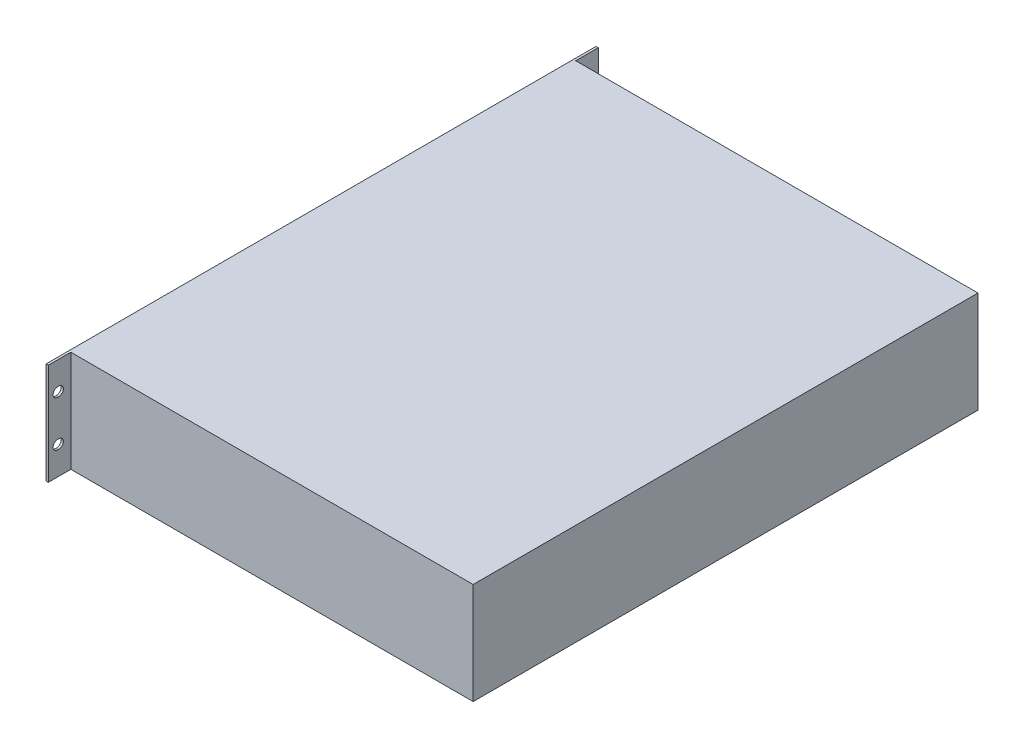
ISO-10303-21;
HEADER;
FILE_DESCRIPTION(('STEP AP214'),'2;1');
FILE_NAME('part.step','',(''),(''),'','','');
FILE_SCHEMA(('AUTOMOTIVE_DESIGN { 1 0 10303 214 1 1 1 1 }'));
ENDSEC;
DATA;
#1=APPLICATION_CONTEXT('core data for automotive mechanical design processes');
#2=APPLICATION_PROTOCOL_DEFINITION('international standard','automotive_design',2000,#1);
#3=PRODUCT_CONTEXT('',#1,'mechanical');
#4=PRODUCT('Part','Part','',(#3));
#5=PRODUCT_RELATED_PRODUCT_CATEGORY('part','',(#4));
#6=PRODUCT_DEFINITION_FORMATION('','',#4);
#7=PRODUCT_DEFINITION_CONTEXT('part definition',#1,'design');
#8=PRODUCT_DEFINITION('design','',#6,#7);
#9=PRODUCT_DEFINITION_SHAPE('','',#8);
#10=(LENGTH_UNIT() NAMED_UNIT(*) SI_UNIT(.MILLI.,.METRE.));
#11=(NAMED_UNIT(*) PLANE_ANGLE_UNIT() SI_UNIT($,.RADIAN.));
#12=(NAMED_UNIT(*) SI_UNIT($,.STERADIAN.) SOLID_ANGLE_UNIT());
#13=UNCERTAINTY_MEASURE_WITH_UNIT(LENGTH_MEASURE(1.E-05),#10,'distance_accuracy_value','');
#14=(GEOMETRIC_REPRESENTATION_CONTEXT(3) GLOBAL_UNCERTAINTY_ASSIGNED_CONTEXT((#13)) GLOBAL_UNIT_ASSIGNED_CONTEXT((#10,
#11,#12)) REPRESENTATION_CONTEXT('',''));
#15=CARTESIAN_POINT('',(0.,0.,0.));
#16=DIRECTION('',(0.,0.,1.));
#17=DIRECTION('',(1.,0.,0.));
#18=AXIS2_PLACEMENT_3D('',#15,#16,#17);
#19=CARTESIAN_POINT('',(177.5,89.,-221.5));
#20=DIRECTION('',(-1.,0.,0.));
#21=DIRECTION('',(0.,0.,1.));
#22=AXIS2_PLACEMENT_3D('',#19,#20,#21);
#23=PLANE('',#22);
#24=DIRECTION('',(0.,0.,-1.));
#25=VECTOR('',#24,1.);
#26=CARTESIAN_POINT('',(177.5,0.,-221.5));
#27=LINE('',#26,#25);
#28=CARTESIAN_POINT('',(177.5,0.,221.5));
#29=VERTEX_POINT('',#28);
#30=CARTESIAN_POINT('',(177.5,0.,-221.5));
#31=VERTEX_POINT('',#30);
#32=EDGE_CURVE('E482',#29,#31,#27,.T.);
#33=ORIENTED_EDGE('',*,*,#32,.T.);
#34=DIRECTION('',(0.,-1.,0.));
#35=VECTOR('',#34,1.);
#36=CARTESIAN_POINT('',(177.5,89.,-221.5));
#37=LINE('',#36,#35);
#38=CARTESIAN_POINT('',(177.5,89.,-221.5));
#39=VERTEX_POINT('',#38);
#40=EDGE_CURVE('E11',#39,#31,#37,.T.);
#41=ORIENTED_EDGE('',*,*,#40,.F.);
#42=DIRECTION('',(0.,0.,-1.));
#43=VECTOR('',#42,1.);
#44=CARTESIAN_POINT('',(177.5,89.,-221.5));
#45=LINE('',#44,#43);
#46=CARTESIAN_POINT('',(177.5,89.,221.5));
#47=VERTEX_POINT('',#46);
#48=EDGE_CURVE('E483',#47,#39,#45,.T.);
#49=ORIENTED_EDGE('',*,*,#48,.F.);
#50=DIRECTION('',(0.,-1.,0.));
#51=VECTOR('',#50,1.);
#52=CARTESIAN_POINT('',(177.5,89.,221.5));
#53=LINE('',#52,#51);
#54=EDGE_CURVE('E48',#47,#29,#53,.T.);
#55=ORIENTED_EDGE('',*,*,#54,.T.);
#56=EDGE_LOOP('',(#33,#41,#49,#55));
#57=FACE_BOUND('',#56,.T.);
#58=ADVANCED_FACE('F40',(#57),#23,.F.);
#59=CARTESIAN_POINT('',(-177.5,89.,-221.5));
#60=DIRECTION('',(0.,0.,1.));
#61=DIRECTION('',(1.,0.,0.));
#62=AXIS2_PLACEMENT_3D('',#59,#60,#61);
#63=PLANE('',#62);
#64=DIRECTION('',(-1.,0.,0.));
#65=VECTOR('',#64,1.);
#66=CARTESIAN_POINT('',(-177.5,0.,-221.5));
#67=LINE('',#66,#65);
#68=CARTESIAN_POINT('',(-175.5,0.,-221.5));
#69=VERTEX_POINT('',#68);
#70=EDGE_CURVE('E500',#31,#69,#67,.T.);
#71=ORIENTED_EDGE('',*,*,#70,.T.);
#72=DIRECTION('',(0.,1.,0.));
#73=VECTOR('',#72,1.);
#74=CARTESIAN_POINT('',(-175.5,89.,-221.5));
#75=LINE('',#74,#73);
#76=CARTESIAN_POINT('',(-175.5,89.,-221.5));
#77=VERTEX_POINT('',#76);
#78=EDGE_CURVE('E478',#69,#77,#75,.T.);
#79=ORIENTED_EDGE('',*,*,#78,.T.);
#80=DIRECTION('',(-1.,0.,0.));
#81=VECTOR('',#80,1.);
#82=CARTESIAN_POINT('',(-177.5,89.,-221.5));
#83=LINE('',#82,#81);
#84=EDGE_CURVE('E487',#39,#77,#83,.T.);
#85=ORIENTED_EDGE('',*,*,#84,.F.);
#86=ORIENTED_EDGE('',*,*,#40,.T.);
#87=EDGE_LOOP('',(#71,#79,#85,#86));
#88=FACE_BOUND('',#87,.T.);
#89=ADVANCED_FACE('F519',(#88),#63,.F.);
#90=CARTESIAN_POINT('',(-177.5,89.,-221.5));
#91=DIRECTION('',(1.,0.,0.));
#92=DIRECTION('',(0.,0.,-1.));
#93=AXIS2_PLACEMENT_3D('',#90,#91,#92);
#94=PLANE('',#93);
#95=DIRECTION('',(0.,0.,1.));
#96=VECTOR('',#95,1.);
#97=CARTESIAN_POINT('',(-177.5,0.,-221.5));
#98=LINE('',#97,#96);
#99=CARTESIAN_POINT('',(-177.5,0.,-241.3));
#100=VERTEX_POINT('',#99);
#101=CARTESIAN_POINT('',(-177.5,0.,241.3));
#102=VERTEX_POINT('',#101);
#103=EDGE_CURVE('E504',#100,#102,#98,.T.);
#104=ORIENTED_EDGE('',*,*,#103,.T.);
#105=DIRECTION('',(0.,1.,0.));
#106=VECTOR('',#105,1.);
#107=CARTESIAN_POINT('',(-177.5,0.,241.3));
#108=LINE('',#107,#106);
#109=CARTESIAN_POINT('',(-177.5,89.,241.3));
#110=VERTEX_POINT('',#109);
#111=EDGE_CURVE('E440',#102,#110,#108,.T.);
#112=ORIENTED_EDGE('',*,*,#111,.T.);
#113=DIRECTION('',(0.,0.,1.));
#114=VECTOR('',#113,1.);
#115=CARTESIAN_POINT('',(-177.5,89.,-221.5));
#116=LINE('',#115,#114);
#117=CARTESIAN_POINT('',(-177.5,89.,-241.3));
#118=VERTEX_POINT('',#117);
#119=EDGE_CURVE('E492',#118,#110,#116,.T.);
#120=ORIENTED_EDGE('',*,*,#119,.F.);
#121=DIRECTION('',(0.,-1.,0.));
#122=VECTOR('',#121,1.);
#123=CARTESIAN_POINT('',(-177.5,0.,-241.3));
#124=LINE('',#123,#122);
#125=EDGE_CURVE('E425',#118,#100,#124,.T.);
#126=ORIENTED_EDGE('',*,*,#125,.T.);
#127=EDGE_LOOP('',(#104,#112,#120,#126));
#128=FACE_BOUND('',#127,.T.);
#129=DIRECTION('',(0.,0.,-1.));
#130=VECTOR('',#129,1.);
#131=CARTESIAN_POINT('',(-177.5,68.5000000000001,233.06));
#132=LINE('',#131,#130);
#133=CARTESIAN_POINT('',(-177.5,68.5000000000001,233.06));
#134=VERTEX_POINT('',#133);
#135=CARTESIAN_POINT('',(-177.5,68.5000000000001,232.06));
#136=VERTEX_POINT('',#135);
#137=EDGE_CURVE('E323',#134,#136,#132,.T.);
#138=ORIENTED_EDGE('',*,*,#137,.F.);
#139=CARTESIAN_POINT('',(-177.5,64.5000000000001,233.06));
#140=DIRECTION('',(-1.,0.,0.));
#141=DIRECTION('',(0.,0.,-1.));
#142=AXIS2_PLACEMENT_3D('',#139,#140,#141);
#143=CIRCLE('',#142,4.00000000000017);
#144=CARTESIAN_POINT('',(-177.5,60.4999999999998,233.06));
#145=VERTEX_POINT('',#144);
#146=EDGE_CURVE('E298',#145,#134,#143,.T.);
#147=ORIENTED_EDGE('',*,*,#146,.F.);
#148=DIRECTION('',(0.,0.,1.));
#149=VECTOR('',#148,1.);
#150=CARTESIAN_POINT('',(-177.5,60.4999999999998,233.06));
#151=LINE('',#150,#149);
#152=CARTESIAN_POINT('',(-177.5,60.4999999999999,232.06));
#153=VERTEX_POINT('',#152);
#154=EDGE_CURVE('E308',#153,#145,#151,.T.);
#155=ORIENTED_EDGE('',*,*,#154,.F.);
#156=CARTESIAN_POINT('',(-177.5,64.5000000000001,232.06));
#157=DIRECTION('',(-1.,0.,0.));
#158=DIRECTION('',(0.,0.,-1.));
#159=AXIS2_PLACEMENT_3D('',#156,#157,#158);
#160=CIRCLE('',#159,4.00000000000017);
#161=EDGE_CURVE('E327',#136,#153,#160,.T.);
#162=ORIENTED_EDGE('',*,*,#161,.F.);
#163=EDGE_LOOP('',(#138,#147,#155,#162));
#164=FACE_BOUND('',#163,.T.);
#165=DIRECTION('',(0.,0.,-1.));
#166=VECTOR('',#165,1.);
#167=CARTESIAN_POINT('',(-177.5,28.5000000000002,233.06));
#168=LINE('',#167,#166);
#169=CARTESIAN_POINT('',(-177.5,28.5000000000002,233.06));
#170=VERTEX_POINT('',#169);
#171=CARTESIAN_POINT('',(-177.5,28.5000000000001,232.06));
#172=VERTEX_POINT('',#171);
#173=EDGE_CURVE('E289',#170,#172,#168,.T.);
#174=ORIENTED_EDGE('',*,*,#173,.F.);
#175=CARTESIAN_POINT('',(-177.5,24.5,233.06));
#176=DIRECTION('',(-1.,0.,0.));
#177=DIRECTION('',(0.,0.,1.));
#178=AXIS2_PLACEMENT_3D('',#175,#176,#177);
#179=CIRCLE('',#178,4.00000000000017);
#180=CARTESIAN_POINT('',(-177.5,20.4999999999999,233.06));
#181=VERTEX_POINT('',#180);
#182=EDGE_CURVE('E254',#181,#170,#179,.T.);
#183=ORIENTED_EDGE('',*,*,#182,.F.);
#184=DIRECTION('',(0.,0.,1.));
#185=VECTOR('',#184,1.);
#186=CARTESIAN_POINT('',(-177.5,20.4999999999999,233.06));
#187=LINE('',#186,#185);
#188=CARTESIAN_POINT('',(-177.5,20.4999999999999,232.06));
#189=VERTEX_POINT('',#188);
#190=EDGE_CURVE('E275',#189,#181,#187,.T.);
#191=ORIENTED_EDGE('',*,*,#190,.F.);
#192=CARTESIAN_POINT('',(-177.5,24.5,232.06));
#193=DIRECTION('',(-1.,0.,0.));
#194=DIRECTION('',(0.,0.,1.));
#195=AXIS2_PLACEMENT_3D('',#192,#193,#194);
#196=CIRCLE('',#195,4.00000000000017);
#197=EDGE_CURVE('E281',#172,#189,#196,.T.);
#198=ORIENTED_EDGE('',*,*,#197,.F.);
#199=EDGE_LOOP('',(#174,#183,#191,#198));
#200=FACE_BOUND('',#199,.T.);
#201=DIRECTION('',(0.,0.,1.));
#202=VECTOR('',#201,1.);
#203=CARTESIAN_POINT('',(-177.5,20.4999999999999,-233.06));
#204=LINE('',#203,#202);
#205=CARTESIAN_POINT('',(-177.5,20.4999999999999,-233.06));
#206=VERTEX_POINT('',#205);
#207=CARTESIAN_POINT('',(-177.5,20.4999999999999,-232.06));
#208=VERTEX_POINT('',#207);
#209=EDGE_CURVE('E367',#206,#208,#204,.T.);
#210=ORIENTED_EDGE('',*,*,#209,.F.);
#211=CARTESIAN_POINT('',(-177.5,24.5,-233.06));
#212=DIRECTION('',(-1.,0.,0.));
#213=DIRECTION('',(0.,0.,-1.));
#214=AXIS2_PLACEMENT_3D('',#211,#212,#213);
#215=CIRCLE('',#214,4.00000000000006);
#216=CARTESIAN_POINT('',(-177.5,28.5,-233.06));
#217=VERTEX_POINT('',#216);
#218=EDGE_CURVE('E337',#217,#206,#215,.T.);
#219=ORIENTED_EDGE('',*,*,#218,.F.);
#220=DIRECTION('',(0.,0.,-1.));
#221=VECTOR('',#220,1.);
#222=CARTESIAN_POINT('',(-177.5,28.5,-233.06));
#223=LINE('',#222,#221);
#224=CARTESIAN_POINT('',(-177.5,28.5,-232.06));
#225=VERTEX_POINT('',#224);
#226=EDGE_CURVE('E352',#225,#217,#223,.T.);
#227=ORIENTED_EDGE('',*,*,#226,.F.);
#228=CARTESIAN_POINT('',(-177.5,24.5,-232.06));
#229=DIRECTION('',(-1.,0.,0.));
#230=DIRECTION('',(0.,0.,-1.));
#231=AXIS2_PLACEMENT_3D('',#228,#229,#230);
#232=CIRCLE('',#231,4.00000000000006);
#233=EDGE_CURVE('E371',#208,#225,#232,.T.);
#234=ORIENTED_EDGE('',*,*,#233,.F.);
#235=EDGE_LOOP('',(#210,#219,#227,#234));
#236=FACE_BOUND('',#235,.T.);
#237=DIRECTION('',(0.,0.,1.));
#238=VECTOR('',#237,1.);
#239=CARTESIAN_POINT('',(-177.5,60.4999999999999,-233.06));
#240=LINE('',#239,#238);
#241=CARTESIAN_POINT('',(-177.5,60.4999999999999,-233.06));
#242=VERTEX_POINT('',#241);
#243=CARTESIAN_POINT('',(-177.5,60.4999999999999,-232.06));
#244=VERTEX_POINT('',#243);
#245=EDGE_CURVE('E411',#242,#244,#240,.T.);
#246=ORIENTED_EDGE('',*,*,#245,.F.);
#247=CARTESIAN_POINT('',(-177.5,64.4999999999999,-233.06));
#248=DIRECTION('',(-1.,0.,0.));
#249=DIRECTION('',(0.,0.,1.));
#250=AXIS2_PLACEMENT_3D('',#247,#248,#249);
#251=CIRCLE('',#250,4.00000000000006);
#252=CARTESIAN_POINT('',(-177.5,68.5,-233.06));
#253=VERTEX_POINT('',#252);
#254=EDGE_CURVE('E381',#253,#242,#251,.T.);
#255=ORIENTED_EDGE('',*,*,#254,.F.);
#256=DIRECTION('',(0.,0.,-1.));
#257=VECTOR('',#256,1.);
#258=CARTESIAN_POINT('',(-177.5,68.5,-233.06));
#259=LINE('',#258,#257);
#260=CARTESIAN_POINT('',(-177.5,68.5,-232.06));
#261=VERTEX_POINT('',#260);
#262=EDGE_CURVE('E396',#261,#253,#259,.T.);
#263=ORIENTED_EDGE('',*,*,#262,.F.);
#264=CARTESIAN_POINT('',(-177.5,64.4999999999999,-232.06));
#265=DIRECTION('',(-1.,0.,0.));
#266=DIRECTION('',(0.,0.,1.));
#267=AXIS2_PLACEMENT_3D('',#264,#265,#266);
#268=CIRCLE('',#267,4.00000000000006);
#269=EDGE_CURVE('E415',#244,#261,#268,.T.);
#270=ORIENTED_EDGE('',*,*,#269,.F.);
#271=EDGE_LOOP('',(#246,#255,#263,#270));
#272=FACE_BOUND('',#271,.T.);
#273=ADVANCED_FACE('F530',(#128,#164,#200,#236,#272),#94,.F.);
#274=CARTESIAN_POINT('',(-177.5,89.,221.5));
#275=DIRECTION('',(0.,0.,-1.));
#276=DIRECTION('',(-1.,0.,0.));
#277=AXIS2_PLACEMENT_3D('',#274,#275,#276);
#278=PLANE('',#277);
#279=DIRECTION('',(1.,0.,0.));
#280=VECTOR('',#279,1.);
#281=CARTESIAN_POINT('',(-177.5,89.,221.5));
#282=LINE('',#281,#280);
#283=CARTESIAN_POINT('',(-175.5,89.,221.5));
#284=VERTEX_POINT('',#283);
#285=EDGE_CURVE('E58',#284,#47,#282,.T.);
#286=ORIENTED_EDGE('',*,*,#285,.F.);
#287=DIRECTION('',(0.,-1.,0.));
#288=VECTOR('',#287,1.);
#289=CARTESIAN_POINT('',(-175.5,89.,221.5));
#290=LINE('',#289,#288);
#291=CARTESIAN_POINT('',(-175.5,0.,221.5));
#292=VERTEX_POINT('',#291);
#293=EDGE_CURVE('E65',#284,#292,#290,.T.);
#294=ORIENTED_EDGE('',*,*,#293,.T.);
#295=DIRECTION('',(1.,0.,0.));
#296=VECTOR('',#295,1.);
#297=CARTESIAN_POINT('',(-177.5,0.,221.5));
#298=LINE('',#297,#296);
#299=EDGE_CURVE('E488',#292,#29,#298,.T.);
#300=ORIENTED_EDGE('',*,*,#299,.T.);
#301=ORIENTED_EDGE('',*,*,#54,.F.);
#302=EDGE_LOOP('',(#286,#294,#300,#301));
#303=FACE_BOUND('',#302,.T.);
#304=ADVANCED_FACE('F561',(#303),#278,.F.);
#305=CARTESIAN_POINT('',(0.,89.,0.));
#306=DIRECTION('',(0.,1.,0.));
#307=DIRECTION('',(0.,0.,1.));
#308=AXIS2_PLACEMENT_3D('',#305,#306,#307);
#309=PLANE('',#308);
#310=ORIENTED_EDGE('',*,*,#84,.T.);
#311=DIRECTION('',(0.,0.,-1.));
#312=VECTOR('',#311,1.);
#313=CARTESIAN_POINT('',(-175.5,89.,-241.3));
#314=LINE('',#313,#312);
#315=CARTESIAN_POINT('',(-175.5,89.,-241.3));
#316=VERTEX_POINT('',#315);
#317=EDGE_CURVE('E449',#77,#316,#314,.T.);
#318=ORIENTED_EDGE('',*,*,#317,.T.);
#319=DIRECTION('',(-1.,0.,0.));
#320=VECTOR('',#319,1.);
#321=CARTESIAN_POINT('',(-175.5,89.,-241.3));
#322=LINE('',#321,#320);
#323=EDGE_CURVE('E461',#316,#118,#322,.T.);
#324=ORIENTED_EDGE('',*,*,#323,.T.);
#325=ORIENTED_EDGE('',*,*,#119,.T.);
#326=DIRECTION('',(-1.,0.,0.));
#327=VECTOR('',#326,1.);
#328=CARTESIAN_POINT('',(-175.5,89.,241.3));
#329=LINE('',#328,#327);
#330=CARTESIAN_POINT('',(-175.5,89.,241.3));
#331=VERTEX_POINT('',#330);
#332=EDGE_CURVE('E465',#331,#110,#329,.T.);
#333=ORIENTED_EDGE('',*,*,#332,.F.);
#334=EDGE_CURVE('E450',#331,#284,#314,.T.);
#335=ORIENTED_EDGE('',*,*,#334,.T.);
#336=ORIENTED_EDGE('',*,*,#285,.T.);
#337=ORIENTED_EDGE('',*,*,#48,.T.);
#338=EDGE_LOOP('',(#310,#318,#324,#325,#333,#335,#336,#337));
#339=FACE_BOUND('',#338,.T.);
#340=ADVANCED_FACE('F521',(#339),#309,.T.);
#341=CARTESIAN_POINT('',(0.,0.,0.));
#342=DIRECTION('',(0.,1.,0.));
#343=DIRECTION('',(0.,0.,1.));
#344=AXIS2_PLACEMENT_3D('',#341,#342,#343);
#345=PLANE('',#344);
#346=ORIENTED_EDGE('',*,*,#299,.F.);
#347=DIRECTION('',(0.,0.,1.));
#348=VECTOR('',#347,1.);
#349=CARTESIAN_POINT('',(-175.5,0.,-241.3));
#350=LINE('',#349,#348);
#351=CARTESIAN_POINT('',(-175.5,0.,241.3));
#352=VERTEX_POINT('',#351);
#353=EDGE_CURVE('E439',#292,#352,#350,.T.);
#354=ORIENTED_EDGE('',*,*,#353,.T.);
#355=DIRECTION('',(-1.,0.,0.));
#356=VECTOR('',#355,1.);
#357=CARTESIAN_POINT('',(-175.5,0.,241.3));
#358=LINE('',#357,#356);
#359=EDGE_CURVE('E469',#352,#102,#358,.T.);
#360=ORIENTED_EDGE('',*,*,#359,.T.);
#361=ORIENTED_EDGE('',*,*,#103,.F.);
#362=DIRECTION('',(-1.,0.,0.));
#363=VECTOR('',#362,1.);
#364=CARTESIAN_POINT('',(-175.5,0.,-241.3));
#365=LINE('',#364,#363);
#366=CARTESIAN_POINT('',(-175.5,0.,-241.3));
#367=VERTEX_POINT('',#366);
#368=EDGE_CURVE('E454',#367,#100,#365,.T.);
#369=ORIENTED_EDGE('',*,*,#368,.F.);
#370=EDGE_CURVE('E441',#367,#69,#350,.T.);
#371=ORIENTED_EDGE('',*,*,#370,.T.);
#372=ORIENTED_EDGE('',*,*,#70,.F.);
#373=ORIENTED_EDGE('',*,*,#32,.F.);
#374=EDGE_LOOP('',(#346,#354,#360,#361,#369,#371,#372,#373));
#375=FACE_BOUND('',#374,.T.);
#376=ADVANCED_FACE('F515',(#375),#345,.F.);
#377=CARTESIAN_POINT('',(-175.5,0.,241.3));
#378=DIRECTION('',(0.,0.,1.));
#379=DIRECTION('',(1.,0.,0.));
#380=AXIS2_PLACEMENT_3D('',#377,#378,#379);
#381=PLANE('',#380);
#382=ORIENTED_EDGE('',*,*,#111,.F.);
#383=ORIENTED_EDGE('',*,*,#359,.F.);
#384=DIRECTION('',(0.,1.,0.));
#385=VECTOR('',#384,1.);
#386=CARTESIAN_POINT('',(-175.5,0.,241.3));
#387=LINE('',#386,#385);
#388=EDGE_CURVE('E445',#352,#331,#387,.T.);
#389=ORIENTED_EDGE('',*,*,#388,.T.);
#390=ORIENTED_EDGE('',*,*,#332,.T.);
#391=EDGE_LOOP('',(#382,#383,#389,#390));
#392=FACE_BOUND('',#391,.T.);
#393=ADVANCED_FACE('F528',(#392),#381,.T.);
#394=CARTESIAN_POINT('',(-175.5,24.5,232.06));
#395=DIRECTION('',(-1.,0.,0.));
#396=DIRECTION('',(0.,0.,1.));
#397=AXIS2_PLACEMENT_3D('',#394,#395,#396);
#398=CYLINDRICAL_SURFACE('',#397,4.00000000000017);
#399=ORIENTED_EDGE('',*,*,#197,.T.);
#400=DIRECTION('',(-1.,0.,0.));
#401=VECTOR('',#400,1.);
#402=CARTESIAN_POINT('',(-175.5,20.4999999999999,232.06));
#403=LINE('',#402,#401);
#404=CARTESIAN_POINT('',(-175.5,20.4999999999999,232.06));
#405=VERTEX_POINT('',#404);
#406=EDGE_CURVE('E299',#405,#189,#403,.T.);
#407=ORIENTED_EDGE('',*,*,#406,.F.);
#408=CARTESIAN_POINT('',(-175.5,24.5,232.06));
#409=DIRECTION('',(-1.,0.,0.));
#410=DIRECTION('',(0.,0.,1.));
#411=AXIS2_PLACEMENT_3D('',#408,#409,#410);
#412=CIRCLE('',#411,4.00000000000017);
#413=CARTESIAN_POINT('',(-175.5,28.5000000000002,232.06));
#414=VERTEX_POINT('',#413);
#415=EDGE_CURVE('E269',#414,#405,#412,.T.);
#416=ORIENTED_EDGE('',*,*,#415,.F.);
#417=DIRECTION('',(-1.,0.,0.));
#418=VECTOR('',#417,1.);
#419=CARTESIAN_POINT('',(-175.5,28.5000000000001,232.06));
#420=LINE('',#419,#418);
#421=EDGE_CURVE('E259',#414,#172,#420,.T.);
#422=ORIENTED_EDGE('',*,*,#421,.T.);
#423=EDGE_LOOP('',(#399,#407,#416,#422));
#424=FACE_BOUND('',#423,.T.);
#425=ADVANCED_FACE('F570',(#424),#398,.F.);
#426=CARTESIAN_POINT('',(-175.5,20.4999999999999,233.06));
#427=DIRECTION('',(0.,-1.,0.));
#428=DIRECTION('',(0.,0.,-1.));
#429=AXIS2_PLACEMENT_3D('',#426,#427,#428);
#430=PLANE('',#429);
#431=ORIENTED_EDGE('',*,*,#190,.T.);
#432=DIRECTION('',(-1.,0.,0.));
#433=VECTOR('',#432,1.);
#434=CARTESIAN_POINT('',(-175.5,20.4999999999999,233.06));
#435=LINE('',#434,#433);
#436=CARTESIAN_POINT('',(-175.5,20.4999999999999,233.06));
#437=VERTEX_POINT('',#436);
#438=EDGE_CURVE('E295',#437,#181,#435,.T.);
#439=ORIENTED_EDGE('',*,*,#438,.F.);
#440=DIRECTION('',(0.,0.,1.));
#441=VECTOR('',#440,1.);
#442=CARTESIAN_POINT('',(-175.5,20.4999999999999,233.06));
#443=LINE('',#442,#441);
#444=EDGE_CURVE('E260',#405,#437,#443,.T.);
#445=ORIENTED_EDGE('',*,*,#444,.F.);
#446=ORIENTED_EDGE('',*,*,#406,.T.);
#447=EDGE_LOOP('',(#431,#439,#445,#446));
#448=FACE_BOUND('',#447,.T.);
#449=ADVANCED_FACE('F574',(#448),#430,.F.);
#450=CARTESIAN_POINT('',(-175.5,24.5,233.06));
#451=DIRECTION('',(-1.,0.,0.));
#452=DIRECTION('',(0.,0.,1.));
#453=AXIS2_PLACEMENT_3D('',#450,#451,#452);
#454=CYLINDRICAL_SURFACE('',#453,4.00000000000017);
#455=ORIENTED_EDGE('',*,*,#182,.T.);
#456=DIRECTION('',(-1.,0.,0.));
#457=VECTOR('',#456,1.);
#458=CARTESIAN_POINT('',(-175.5,28.5000000000002,233.06));
#459=LINE('',#458,#457);
#460=CARTESIAN_POINT('',(-175.5,28.5000000000002,233.06));
#461=VERTEX_POINT('',#460);
#462=EDGE_CURVE('E247',#461,#170,#459,.T.);
#463=ORIENTED_EDGE('',*,*,#462,.F.);
#464=CARTESIAN_POINT('',(-175.5,24.5,233.06));
#465=DIRECTION('',(-1.,0.,0.));
#466=DIRECTION('',(0.,0.,1.));
#467=AXIS2_PLACEMENT_3D('',#464,#465,#466);
#468=CIRCLE('',#467,4.00000000000017);
#469=EDGE_CURVE('E251',#437,#461,#468,.T.);
#470=ORIENTED_EDGE('',*,*,#469,.F.);
#471=ORIENTED_EDGE('',*,*,#438,.T.);
#472=EDGE_LOOP('',(#455,#463,#470,#471));
#473=FACE_BOUND('',#472,.T.);
#474=ADVANCED_FACE('F249',(#473),#454,.F.);
#475=CARTESIAN_POINT('',(-175.5,28.5000000000002,233.06));
#476=DIRECTION('',(0.,1.,0.));
#477=DIRECTION('',(0.,0.,1.));
#478=AXIS2_PLACEMENT_3D('',#475,#476,#477);
#479=PLANE('',#478);
#480=ORIENTED_EDGE('',*,*,#173,.T.);
#481=ORIENTED_EDGE('',*,*,#421,.F.);
#482=DIRECTION('',(0.,0.,-1.));
#483=VECTOR('',#482,1.);
#484=CARTESIAN_POINT('',(-175.5,28.5000000000002,233.06));
#485=LINE('',#484,#483);
#486=EDGE_CURVE('E264',#461,#414,#485,.T.);
#487=ORIENTED_EDGE('',*,*,#486,.F.);
#488=ORIENTED_EDGE('',*,*,#462,.T.);
#489=EDGE_LOOP('',(#480,#481,#487,#488));
#490=FACE_BOUND('',#489,.T.);
#491=ADVANCED_FACE('F265',(#490),#479,.F.);
#492=CARTESIAN_POINT('',(-175.5,64.5000000000001,232.06));
#493=DIRECTION('',(-1.,0.,0.));
#494=DIRECTION('',(0.,0.,1.));
#495=AXIS2_PLACEMENT_3D('',#492,#493,#494);
#496=CYLINDRICAL_SURFACE('',#495,4.00000000000017);
#497=ORIENTED_EDGE('',*,*,#161,.T.);
#498=DIRECTION('',(-1.,0.,0.));
#499=VECTOR('',#498,1.);
#500=CARTESIAN_POINT('',(-175.5,60.4999999999999,232.06));
#501=LINE('',#500,#499);
#502=CARTESIAN_POINT('',(-175.5,60.4999999999999,232.06));
#503=VERTEX_POINT('',#502);
#504=EDGE_CURVE('E338',#503,#153,#501,.T.);
#505=ORIENTED_EDGE('',*,*,#504,.F.);
#506=CARTESIAN_POINT('',(-175.5,64.5000000000001,232.06));
#507=DIRECTION('',(-1.,0.,0.));
#508=DIRECTION('',(0.,0.,-1.));
#509=AXIS2_PLACEMENT_3D('',#506,#507,#508);
#510=CIRCLE('',#509,4.00000000000017);
#511=CARTESIAN_POINT('',(-175.5,68.5000000000001,232.06));
#512=VERTEX_POINT('',#511);
#513=EDGE_CURVE('E312',#512,#503,#510,.T.);
#514=ORIENTED_EDGE('',*,*,#513,.F.);
#515=DIRECTION('',(-1.,0.,0.));
#516=VECTOR('',#515,1.);
#517=CARTESIAN_POINT('',(-175.5,68.5000000000001,232.06));
#518=LINE('',#517,#516);
#519=EDGE_CURVE('E341',#512,#136,#518,.T.);
#520=ORIENTED_EDGE('',*,*,#519,.T.);
#521=EDGE_LOOP('',(#497,#505,#514,#520));
#522=FACE_BOUND('',#521,.T.);
#523=ADVANCED_FACE('F585',(#522),#496,.F.);
#524=CARTESIAN_POINT('',(-175.5,60.4999999999998,233.06));
#525=DIRECTION('',(0.,-1.,0.));
#526=DIRECTION('',(0.,0.,-1.));
#527=AXIS2_PLACEMENT_3D('',#524,#525,#526);
#528=PLANE('',#527);
#529=ORIENTED_EDGE('',*,*,#154,.T.);
#530=DIRECTION('',(-1.,0.,0.));
#531=VECTOR('',#530,1.);
#532=CARTESIAN_POINT('',(-175.5,60.4999999999998,233.06));
#533=LINE('',#532,#531);
#534=CARTESIAN_POINT('',(-175.5,60.4999999999998,233.06));
#535=VERTEX_POINT('',#534);
#536=EDGE_CURVE('E334',#535,#145,#533,.T.);
#537=ORIENTED_EDGE('',*,*,#536,.F.);
#538=DIRECTION('',(0.,0.,1.));
#539=VECTOR('',#538,1.);
#540=CARTESIAN_POINT('',(-175.5,60.4999999999998,233.06));
#541=LINE('',#540,#539);
#542=EDGE_CURVE('E316',#503,#535,#541,.T.);
#543=ORIENTED_EDGE('',*,*,#542,.F.);
#544=ORIENTED_EDGE('',*,*,#504,.T.);
#545=EDGE_LOOP('',(#529,#537,#543,#544));
#546=FACE_BOUND('',#545,.T.);
#547=ADVANCED_FACE('F588',(#546),#528,.F.);
#548=CARTESIAN_POINT('',(-175.5,64.5000000000001,233.06));
#549=DIRECTION('',(-1.,0.,0.));
#550=DIRECTION('',(0.,0.,1.));
#551=AXIS2_PLACEMENT_3D('',#548,#549,#550);
#552=CYLINDRICAL_SURFACE('',#551,4.00000000000017);
#553=ORIENTED_EDGE('',*,*,#146,.T.);
#554=DIRECTION('',(-1.,0.,0.));
#555=VECTOR('',#554,1.);
#556=CARTESIAN_POINT('',(-175.5,68.5000000000001,233.06));
#557=LINE('',#556,#555);
#558=CARTESIAN_POINT('',(-175.5,68.5000000000001,233.06));
#559=VERTEX_POINT('',#558);
#560=EDGE_CURVE('E320',#559,#134,#557,.T.);
#561=ORIENTED_EDGE('',*,*,#560,.F.);
#562=CARTESIAN_POINT('',(-175.5,64.5000000000001,233.06));
#563=DIRECTION('',(-1.,0.,0.));
#564=DIRECTION('',(0.,0.,-1.));
#565=AXIS2_PLACEMENT_3D('',#562,#563,#564);
#566=CIRCLE('',#565,4.00000000000017);
#567=EDGE_CURVE('E303',#535,#559,#566,.T.);
#568=ORIENTED_EDGE('',*,*,#567,.F.);
#569=ORIENTED_EDGE('',*,*,#536,.T.);
#570=EDGE_LOOP('',(#553,#561,#568,#569));
#571=FACE_BOUND('',#570,.T.);
#572=ADVANCED_FACE('F591',(#571),#552,.F.);
#573=CARTESIAN_POINT('',(-175.5,68.5000000000001,233.06));
#574=DIRECTION('',(0.,1.,0.));
#575=DIRECTION('',(0.,0.,1.));
#576=AXIS2_PLACEMENT_3D('',#573,#574,#575);
#577=PLANE('',#576);
#578=ORIENTED_EDGE('',*,*,#137,.T.);
#579=ORIENTED_EDGE('',*,*,#519,.F.);
#580=DIRECTION('',(0.,0.,-1.));
#581=VECTOR('',#580,1.);
#582=CARTESIAN_POINT('',(-175.5,68.5000000000001,233.06));
#583=LINE('',#582,#581);
#584=EDGE_CURVE('E307',#559,#512,#583,.T.);
#585=ORIENTED_EDGE('',*,*,#584,.F.);
#586=ORIENTED_EDGE('',*,*,#560,.T.);
#587=EDGE_LOOP('',(#578,#579,#585,#586));
#588=FACE_BOUND('',#587,.T.);
#589=ADVANCED_FACE('F549',(#588),#577,.F.);
#590=CARTESIAN_POINT('',(-175.5,0.,0.));
#591=DIRECTION('',(1.,0.,0.));
#592=DIRECTION('',(0.,0.,-1.));
#593=AXIS2_PLACEMENT_3D('',#590,#591,#592);
#594=PLANE('',#593);
#595=ORIENTED_EDGE('',*,*,#567,.T.);
#596=ORIENTED_EDGE('',*,*,#584,.T.);
#597=ORIENTED_EDGE('',*,*,#513,.T.);
#598=ORIENTED_EDGE('',*,*,#542,.T.);
#599=EDGE_LOOP('',(#595,#596,#597,#598));
#600=FACE_BOUND('',#599,.T.);
#601=ORIENTED_EDGE('',*,*,#469,.T.);
#602=ORIENTED_EDGE('',*,*,#486,.T.);
#603=ORIENTED_EDGE('',*,*,#415,.T.);
#604=ORIENTED_EDGE('',*,*,#444,.T.);
#605=EDGE_LOOP('',(#601,#602,#603,#604));
#606=FACE_BOUND('',#605,.T.);
#607=ORIENTED_EDGE('',*,*,#293,.F.);
#608=ORIENTED_EDGE('',*,*,#334,.F.);
#609=ORIENTED_EDGE('',*,*,#388,.F.);
#610=ORIENTED_EDGE('',*,*,#353,.F.);
#611=EDGE_LOOP('',(#607,#608,#609,#610));
#612=FACE_BOUND('',#611,.T.);
#613=ADVANCED_FACE('F271',(#600,#606,#612),#594,.T.);
#614=CARTESIAN_POINT('',(-175.5,64.4999999999999,-233.06));
#615=DIRECTION('',(-1.,0.,0.));
#616=DIRECTION('',(0.,0.,1.));
#617=AXIS2_PLACEMENT_3D('',#614,#615,#616);
#618=CIRCLE('',#617,4.00000000000006);
#619=CARTESIAN_POINT('',(-175.5,68.5,-233.06));
#620=VERTEX_POINT('',#619);
#621=CARTESIAN_POINT('',(-175.5,60.4999999999999,-233.06));
#622=VERTEX_POINT('',#621);
#623=EDGE_CURVE('E391',#620,#622,#618,.T.);
#624=ORIENTED_EDGE('',*,*,#623,.T.);
#625=DIRECTION('',(0.,0.,1.));
#626=VECTOR('',#625,1.);
#627=CARTESIAN_POINT('',(-175.5,60.4999999999999,-233.06));
#628=LINE('',#627,#626);
#629=CARTESIAN_POINT('',(-175.5,60.4999999999999,-232.06));
#630=VERTEX_POINT('',#629);
#631=EDGE_CURVE('E395',#622,#630,#628,.T.);
#632=ORIENTED_EDGE('',*,*,#631,.T.);
#633=CARTESIAN_POINT('',(-175.5,64.4999999999999,-232.06));
#634=DIRECTION('',(-1.,0.,0.));
#635=DIRECTION('',(0.,0.,1.));
#636=AXIS2_PLACEMENT_3D('',#633,#634,#635);
#637=CIRCLE('',#636,4.00000000000006);
#638=CARTESIAN_POINT('',(-175.5,68.5,-232.06));
#639=VERTEX_POINT('',#638);
#640=EDGE_CURVE('E400',#630,#639,#637,.T.);
#641=ORIENTED_EDGE('',*,*,#640,.T.);
#642=DIRECTION('',(0.,0.,-1.));
#643=VECTOR('',#642,1.);
#644=CARTESIAN_POINT('',(-175.5,68.5,-233.06));
#645=LINE('',#644,#643);
#646=EDGE_CURVE('E404',#639,#620,#645,.T.);
#647=ORIENTED_EDGE('',*,*,#646,.T.);
#648=EDGE_LOOP('',(#624,#632,#641,#647));
#649=FACE_BOUND('',#648,.T.);
#650=CARTESIAN_POINT('',(-175.5,24.5,-233.06));
#651=DIRECTION('',(-1.,0.,0.));
#652=DIRECTION('',(0.,0.,-1.));
#653=AXIS2_PLACEMENT_3D('',#650,#651,#652);
#654=CIRCLE('',#653,4.00000000000006);
#655=CARTESIAN_POINT('',(-175.5,28.5,-233.06));
#656=VERTEX_POINT('',#655);
#657=CARTESIAN_POINT('',(-175.5,20.4999999999999,-233.06));
#658=VERTEX_POINT('',#657);
#659=EDGE_CURVE('E347',#656,#658,#654,.T.);
#660=ORIENTED_EDGE('',*,*,#659,.T.);
#661=DIRECTION('',(0.,0.,1.));
#662=VECTOR('',#661,1.);
#663=CARTESIAN_POINT('',(-175.5,20.4999999999999,-233.06));
#664=LINE('',#663,#662);
#665=CARTESIAN_POINT('',(-175.5,20.4999999999999,-232.06));
#666=VERTEX_POINT('',#665);
#667=EDGE_CURVE('E351',#658,#666,#664,.T.);
#668=ORIENTED_EDGE('',*,*,#667,.T.);
#669=CARTESIAN_POINT('',(-175.5,24.5,-232.06));
#670=DIRECTION('',(-1.,0.,0.));
#671=DIRECTION('',(0.,0.,-1.));
#672=AXIS2_PLACEMENT_3D('',#669,#670,#671);
#673=CIRCLE('',#672,4.00000000000006);
#674=CARTESIAN_POINT('',(-175.5,28.5,-232.06));
#675=VERTEX_POINT('',#674);
#676=EDGE_CURVE('E356',#666,#675,#673,.T.);
#677=ORIENTED_EDGE('',*,*,#676,.T.);
#678=DIRECTION('',(0.,0.,-1.));
#679=VECTOR('',#678,1.);
#680=CARTESIAN_POINT('',(-175.5,28.5,-233.06));
#681=LINE('',#680,#679);
#682=EDGE_CURVE('E360',#675,#656,#681,.T.);
#683=ORIENTED_EDGE('',*,*,#682,.T.);
#684=EDGE_LOOP('',(#660,#668,#677,#683));
#685=FACE_BOUND('',#684,.T.);
#686=ORIENTED_EDGE('',*,*,#78,.F.);
#687=ORIENTED_EDGE('',*,*,#370,.F.);
#688=DIRECTION('',(0.,-1.,0.));
#689=VECTOR('',#688,1.);
#690=CARTESIAN_POINT('',(-175.5,0.,-241.3));
#691=LINE('',#690,#689);
#692=EDGE_CURVE('E435',#316,#367,#691,.T.);
#693=ORIENTED_EDGE('',*,*,#692,.F.);
#694=ORIENTED_EDGE('',*,*,#317,.F.);
#695=EDGE_LOOP('',(#686,#687,#693,#694));
#696=FACE_BOUND('',#695,.T.);
#697=ADVANCED_FACE('F538',(#649,#685,#696),#594,.T.);
#698=CARTESIAN_POINT('',(-175.5,0.,-241.3));
#699=DIRECTION('',(0.,0.,-1.));
#700=DIRECTION('',(-1.,0.,0.));
#701=AXIS2_PLACEMENT_3D('',#698,#699,#700);
#702=PLANE('',#701);
#703=ORIENTED_EDGE('',*,*,#125,.F.);
#704=ORIENTED_EDGE('',*,*,#323,.F.);
#705=ORIENTED_EDGE('',*,*,#692,.T.);
#706=ORIENTED_EDGE('',*,*,#368,.T.);
#707=EDGE_LOOP('',(#703,#704,#705,#706));
#708=FACE_BOUND('',#707,.T.);
#709=ADVANCED_FACE('F534',(#708),#702,.T.);
#710=CARTESIAN_POINT('',(-175.5,64.4999999999999,-233.06));
#711=DIRECTION('',(-1.,0.,0.));
#712=DIRECTION('',(0.,0.,1.));
#713=AXIS2_PLACEMENT_3D('',#710,#711,#712);
#714=CYLINDRICAL_SURFACE('',#713,4.00000000000006);
#715=ORIENTED_EDGE('',*,*,#254,.T.);
#716=DIRECTION('',(-1.,0.,0.));
#717=VECTOR('',#716,1.);
#718=CARTESIAN_POINT('',(-175.5,60.4999999999999,-233.06));
#719=LINE('',#718,#717);
#720=EDGE_CURVE('E408',#622,#242,#719,.T.);
#721=ORIENTED_EDGE('',*,*,#720,.F.);
#722=ORIENTED_EDGE('',*,*,#623,.F.);
#723=DIRECTION('',(-1.,0.,0.));
#724=VECTOR('',#723,1.);
#725=CARTESIAN_POINT('',(-175.5,68.5,-233.06));
#726=LINE('',#725,#724);
#727=EDGE_CURVE('E422',#620,#253,#726,.T.);
#728=ORIENTED_EDGE('',*,*,#727,.T.);
#729=EDGE_LOOP('',(#715,#721,#722,#728));
#730=FACE_BOUND('',#729,.T.);
#731=ADVANCED_FACE('F547',(#730),#714,.F.);
#732=CARTESIAN_POINT('',(-175.5,68.5,-233.06));
#733=DIRECTION('',(0.,1.,0.));
#734=DIRECTION('',(0.,0.,1.));
#735=AXIS2_PLACEMENT_3D('',#732,#733,#734);
#736=PLANE('',#735);
#737=ORIENTED_EDGE('',*,*,#262,.T.);
#738=ORIENTED_EDGE('',*,*,#727,.F.);
#739=ORIENTED_EDGE('',*,*,#646,.F.);
#740=DIRECTION('',(-1.,0.,0.));
#741=VECTOR('',#740,1.);
#742=CARTESIAN_POINT('',(-175.5,68.5,-232.06));
#743=LINE('',#742,#741);
#744=EDGE_CURVE('E426',#639,#261,#743,.T.);
#745=ORIENTED_EDGE('',*,*,#744,.T.);
#746=EDGE_LOOP('',(#737,#738,#739,#745));
#747=FACE_BOUND('',#746,.T.);
#748=ADVANCED_FACE('F619',(#747),#736,.F.);
#749=CARTESIAN_POINT('',(-175.5,64.4999999999999,-232.06));
#750=DIRECTION('',(-1.,0.,0.));
#751=DIRECTION('',(0.,0.,1.));
#752=AXIS2_PLACEMENT_3D('',#749,#750,#751);
#753=CYLINDRICAL_SURFACE('',#752,4.00000000000006);
#754=ORIENTED_EDGE('',*,*,#269,.T.);
#755=ORIENTED_EDGE('',*,*,#744,.F.);
#756=ORIENTED_EDGE('',*,*,#640,.F.);
#757=DIRECTION('',(-1.,0.,0.));
#758=VECTOR('',#757,1.);
#759=CARTESIAN_POINT('',(-175.5,60.4999999999999,-232.06));
#760=LINE('',#759,#758);
#761=EDGE_CURVE('E429',#630,#244,#760,.T.);
#762=ORIENTED_EDGE('',*,*,#761,.T.);
#763=EDGE_LOOP('',(#754,#755,#756,#762));
#764=FACE_BOUND('',#763,.T.);
#765=ADVANCED_FACE('F622',(#764),#753,.F.);
#766=CARTESIAN_POINT('',(-175.5,60.4999999999999,-233.06));
#767=DIRECTION('',(0.,-1.,0.));
#768=DIRECTION('',(0.,0.,-1.));
#769=AXIS2_PLACEMENT_3D('',#766,#767,#768);
#770=PLANE('',#769);
#771=ORIENTED_EDGE('',*,*,#245,.T.);
#772=ORIENTED_EDGE('',*,*,#761,.F.);
#773=ORIENTED_EDGE('',*,*,#631,.F.);
#774=ORIENTED_EDGE('',*,*,#720,.T.);
#775=EDGE_LOOP('',(#771,#772,#773,#774));
#776=FACE_BOUND('',#775,.T.);
#777=ADVANCED_FACE('F617',(#776),#770,.F.);
#778=CARTESIAN_POINT('',(-175.5,24.5,-233.06));
#779=DIRECTION('',(-1.,0.,0.));
#780=DIRECTION('',(0.,0.,1.));
#781=AXIS2_PLACEMENT_3D('',#778,#779,#780);
#782=CYLINDRICAL_SURFACE('',#781,4.00000000000006);
#783=ORIENTED_EDGE('',*,*,#218,.T.);
#784=DIRECTION('',(-1.,0.,0.));
#785=VECTOR('',#784,1.);
#786=CARTESIAN_POINT('',(-175.5,20.4999999999999,-233.06));
#787=LINE('',#786,#785);
#788=EDGE_CURVE('E364',#658,#206,#787,.T.);
#789=ORIENTED_EDGE('',*,*,#788,.F.);
#790=ORIENTED_EDGE('',*,*,#659,.F.);
#791=DIRECTION('',(-1.,0.,0.));
#792=VECTOR('',#791,1.);
#793=CARTESIAN_POINT('',(-175.5,28.5,-233.06));
#794=LINE('',#793,#792);
#795=EDGE_CURVE('E378',#656,#217,#794,.T.);
#796=ORIENTED_EDGE('',*,*,#795,.T.);
#797=EDGE_LOOP('',(#783,#789,#790,#796));
#798=FACE_BOUND('',#797,.T.);
#799=ADVANCED_FACE('F606',(#798),#782,.F.);
#800=CARTESIAN_POINT('',(-175.5,28.5,-233.06));
#801=DIRECTION('',(0.,1.,0.));
#802=DIRECTION('',(0.,0.,1.));
#803=AXIS2_PLACEMENT_3D('',#800,#801,#802);
#804=PLANE('',#803);
#805=ORIENTED_EDGE('',*,*,#226,.T.);
#806=ORIENTED_EDGE('',*,*,#795,.F.);
#807=ORIENTED_EDGE('',*,*,#682,.F.);
#808=DIRECTION('',(-1.,0.,0.));
#809=VECTOR('',#808,1.);
#810=CARTESIAN_POINT('',(-175.5,28.5,-232.06));
#811=LINE('',#810,#809);
#812=EDGE_CURVE('E382',#675,#225,#811,.T.);
#813=ORIENTED_EDGE('',*,*,#812,.T.);
#814=EDGE_LOOP('',(#805,#806,#807,#813));
#815=FACE_BOUND('',#814,.T.);
#816=ADVANCED_FACE('F602',(#815),#804,.F.);
#817=CARTESIAN_POINT('',(-175.5,24.5,-232.06));
#818=DIRECTION('',(-1.,0.,0.));
#819=DIRECTION('',(0.,0.,1.));
#820=AXIS2_PLACEMENT_3D('',#817,#818,#819);
#821=CYLINDRICAL_SURFACE('',#820,4.00000000000006);
#822=ORIENTED_EDGE('',*,*,#233,.T.);
#823=ORIENTED_EDGE('',*,*,#812,.F.);
#824=ORIENTED_EDGE('',*,*,#676,.F.);
#825=DIRECTION('',(-1.,0.,0.));
#826=VECTOR('',#825,1.);
#827=CARTESIAN_POINT('',(-175.5,20.4999999999999,-232.06));
#828=LINE('',#827,#826);
#829=EDGE_CURVE('E385',#666,#208,#828,.T.);
#830=ORIENTED_EDGE('',*,*,#829,.T.);
#831=EDGE_LOOP('',(#822,#823,#824,#830));
#832=FACE_BOUND('',#831,.T.);
#833=ADVANCED_FACE('F605',(#832),#821,.F.);
#834=CARTESIAN_POINT('',(-175.5,20.4999999999999,-233.06));
#835=DIRECTION('',(0.,-1.,0.));
#836=DIRECTION('',(0.,0.,-1.));
#837=AXIS2_PLACEMENT_3D('',#834,#835,#836);
#838=PLANE('',#837);
#839=ORIENTED_EDGE('',*,*,#209,.T.);
#840=ORIENTED_EDGE('',*,*,#829,.F.);
#841=ORIENTED_EDGE('',*,*,#667,.F.);
#842=ORIENTED_EDGE('',*,*,#788,.T.);
#843=EDGE_LOOP('',(#839,#840,#841,#842));
#844=FACE_BOUND('',#843,.T.);
#845=ADVANCED_FACE('F610',(#844),#838,.F.);
#846=CLOSED_SHELL('',(#58,#89,#273,#304,#340,#376,#393,#425,#449,#474,#491,#523,#547,#572,#589,
#613,#697,#709,#731,#748,#765,#777,#799,#816,#833,#845));
#847=MANIFOLD_SOLID_BREP('B2',#846);
#848=ADVANCED_BREP_SHAPE_REPRESENTATION('',(#18,#847),#14);
#849=SHAPE_DEFINITION_REPRESENTATION(#9,#848);
ENDSEC;
END-ISO-10303-21;
